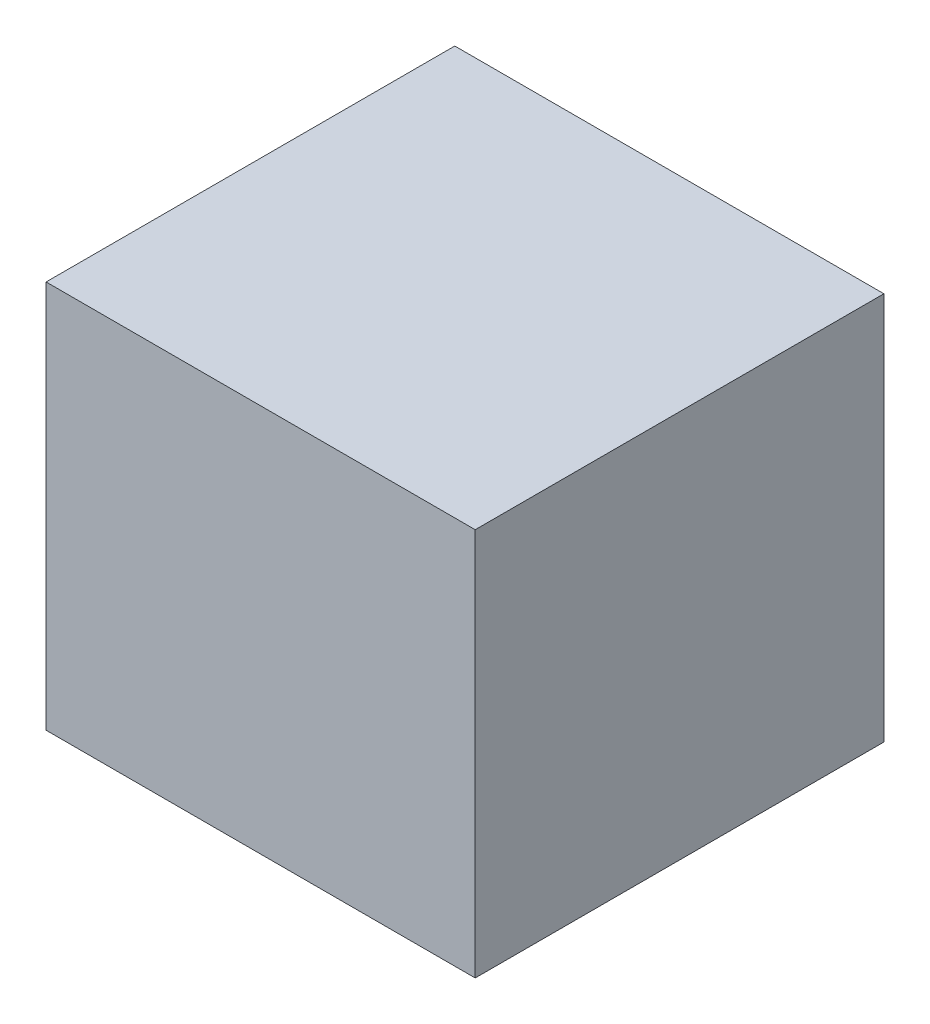
ISO-10303-21;
HEADER;
FILE_DESCRIPTION(('STEP AP214'),'2;1');
FILE_NAME('part.step','',(''),(''),'','','');
FILE_SCHEMA(('AUTOMOTIVE_DESIGN { 1 0 10303 214 1 1 1 1 }'));
ENDSEC;
DATA;
#1=APPLICATION_CONTEXT('core data for automotive mechanical design processes');
#2=APPLICATION_PROTOCOL_DEFINITION('international standard','automotive_design',2000,#1);
#3=PRODUCT_CONTEXT('',#1,'mechanical');
#4=PRODUCT('Part','Part','',(#3));
#5=PRODUCT_RELATED_PRODUCT_CATEGORY('part','',(#4));
#6=PRODUCT_DEFINITION_FORMATION('','',#4);
#7=PRODUCT_DEFINITION_CONTEXT('part definition',#1,'design');
#8=PRODUCT_DEFINITION('design','',#6,#7);
#9=PRODUCT_DEFINITION_SHAPE('','',#8);
#10=(LENGTH_UNIT() NAMED_UNIT(*) SI_UNIT(.MILLI.,.METRE.));
#11=(NAMED_UNIT(*) PLANE_ANGLE_UNIT() SI_UNIT($,.RADIAN.));
#12=(NAMED_UNIT(*) SI_UNIT($,.STERADIAN.) SOLID_ANGLE_UNIT());
#13=UNCERTAINTY_MEASURE_WITH_UNIT(LENGTH_MEASURE(1.E-05),#10,'distance_accuracy_value','');
#14=(GEOMETRIC_REPRESENTATION_CONTEXT(3) GLOBAL_UNCERTAINTY_ASSIGNED_CONTEXT((#13)) GLOBAL_UNIT_ASSIGNED_CONTEXT((#10,
#11,#12)) REPRESENTATION_CONTEXT('',''));
#15=CARTESIAN_POINT('',(0.,0.,0.));
#16=DIRECTION('',(0.,0.,1.));
#17=DIRECTION('',(1.,0.,0.));
#18=AXIS2_PLACEMENT_3D('',#15,#16,#17);
#19=CARTESIAN_POINT('',(0.52500022,-0.47499778,0.));
#20=DIRECTION('',(-1.,0.,0.));
#21=DIRECTION('',(0.,1.,0.));
#22=AXIS2_PLACEMENT_3D('',#19,#20,#21);
#23=PLANE('',#22);
#24=DIRECTION('',(0.,1.,0.));
#25=VECTOR('',#24,1.);
#26=CARTESIAN_POINT('',(0.52500022,-0.47499778,0.));
#27=LINE('',#26,#25);
#28=CARTESIAN_POINT('',(0.52500022,-0.47499778,0.));
#29=VERTEX_POINT('',#28);
#30=CARTESIAN_POINT('',(0.52500022,0.47500032,0.));
#31=VERTEX_POINT('',#30);
#32=EDGE_CURVE('E11',#29,#31,#27,.T.);
#33=ORIENTED_EDGE('',*,*,#32,.T.);
#34=DIRECTION('',(0.,0.,1.));
#35=VECTOR('',#34,1.);
#36=CARTESIAN_POINT('',(0.52500022,0.47500032,0.));
#37=LINE('',#36,#35);
#38=CARTESIAN_POINT('',(0.52500022,0.47500032,1.00000054));
#39=VERTEX_POINT('',#38);
#40=EDGE_CURVE('E24',#31,#39,#37,.T.);
#41=ORIENTED_EDGE('',*,*,#40,.T.);
#42=DIRECTION('',(0.,1.,0.));
#43=VECTOR('',#42,1.);
#44=CARTESIAN_POINT('',(0.52500022,-0.47499778,1.00000054));
#45=LINE('',#44,#43);
#46=CARTESIAN_POINT('',(0.52500022,-0.47499778,1.00000054));
#47=VERTEX_POINT('',#46);
#48=EDGE_CURVE('E87',#47,#39,#45,.T.);
#49=ORIENTED_EDGE('',*,*,#48,.F.);
#50=DIRECTION('',(0.,0.,1.));
#51=VECTOR('',#50,1.);
#52=CARTESIAN_POINT('',(0.52500022,-0.47499778,0.));
#53=LINE('',#52,#51);
#54=EDGE_CURVE('E36',#29,#47,#53,.T.);
#55=ORIENTED_EDGE('',*,*,#54,.F.);
#56=EDGE_LOOP('',(#33,#41,#49,#55));
#57=FACE_BOUND('',#56,.T.);
#58=ADVANCED_FACE('F17',(#57),#23,.F.);
#59=CARTESIAN_POINT('',(0.52500022,0.47500032,0.));
#60=DIRECTION('',(0.,-1.,0.));
#61=DIRECTION('',(-1.,0.,0.));
#62=AXIS2_PLACEMENT_3D('',#59,#60,#61);
#63=PLANE('',#62);
#64=DIRECTION('',(-1.,0.,0.));
#65=VECTOR('',#64,1.);
#66=CARTESIAN_POINT('',(0.52500022,0.47500032,0.));
#67=LINE('',#66,#65);
#68=CARTESIAN_POINT('',(-0.52500022,0.47500032,0.));
#69=VERTEX_POINT('',#68);
#70=EDGE_CURVE('E84',#31,#69,#67,.T.);
#71=ORIENTED_EDGE('',*,*,#70,.T.);
#72=DIRECTION('',(0.,0.,1.));
#73=VECTOR('',#72,1.);
#74=CARTESIAN_POINT('',(-0.52500022,0.47500032,0.));
#75=LINE('',#74,#73);
#76=CARTESIAN_POINT('',(-0.52500022,0.47500032,1.00000054));
#77=VERTEX_POINT('',#76);
#78=EDGE_CURVE('E82',#69,#77,#75,.T.);
#79=ORIENTED_EDGE('',*,*,#78,.T.);
#80=DIRECTION('',(-1.,0.,0.));
#81=VECTOR('',#80,1.);
#82=CARTESIAN_POINT('',(0.52500022,0.47500032,1.00000054));
#83=LINE('',#82,#81);
#84=EDGE_CURVE('E62',#39,#77,#83,.T.);
#85=ORIENTED_EDGE('',*,*,#84,.F.);
#86=ORIENTED_EDGE('',*,*,#40,.F.);
#87=EDGE_LOOP('',(#71,#79,#85,#86));
#88=FACE_BOUND('',#87,.T.);
#89=ADVANCED_FACE('F89',(#88),#63,.F.);
#90=CARTESIAN_POINT('',(-0.52500022,0.47500032,0.));
#91=DIRECTION('',(1.,0.,0.));
#92=DIRECTION('',(0.,-1.,0.));
#93=AXIS2_PLACEMENT_3D('',#90,#91,#92);
#94=PLANE('',#93);
#95=DIRECTION('',(0.,-1.,0.));
#96=VECTOR('',#95,1.);
#97=CARTESIAN_POINT('',(-0.52500022,0.47500032,0.));
#98=LINE('',#97,#96);
#99=CARTESIAN_POINT('',(-0.52500022,-0.47499778,0.));
#100=VERTEX_POINT('',#99);
#101=EDGE_CURVE('E71',#69,#100,#98,.T.);
#102=ORIENTED_EDGE('',*,*,#101,.T.);
#103=DIRECTION('',(0.,0.,1.));
#104=VECTOR('',#103,1.);
#105=CARTESIAN_POINT('',(-0.52500022,-0.47499778,0.));
#106=LINE('',#105,#104);
#107=CARTESIAN_POINT('',(-0.52500022,-0.47499778,1.00000054));
#108=VERTEX_POINT('',#107);
#109=EDGE_CURVE('E65',#100,#108,#106,.T.);
#110=ORIENTED_EDGE('',*,*,#109,.T.);
#111=DIRECTION('',(0.,-1.,0.));
#112=VECTOR('',#111,1.);
#113=CARTESIAN_POINT('',(-0.52500022,0.47500032,1.00000054));
#114=LINE('',#113,#112);
#115=EDGE_CURVE('E57',#77,#108,#114,.T.);
#116=ORIENTED_EDGE('',*,*,#115,.F.);
#117=ORIENTED_EDGE('',*,*,#78,.F.);
#118=EDGE_LOOP('',(#102,#110,#116,#117));
#119=FACE_BOUND('',#118,.T.);
#120=ADVANCED_FACE('F69',(#119),#94,.F.);
#121=CARTESIAN_POINT('',(-0.52500022,-0.47499778,0.));
#122=DIRECTION('',(0.,1.,0.));
#123=DIRECTION('',(1.,0.,0.));
#124=AXIS2_PLACEMENT_3D('',#121,#122,#123);
#125=PLANE('',#124);
#126=DIRECTION('',(1.,0.,0.));
#127=VECTOR('',#126,1.);
#128=CARTESIAN_POINT('',(-0.52500022,-0.47499778,0.));
#129=LINE('',#128,#127);
#130=EDGE_CURVE('E66',#100,#29,#129,.T.);
#131=ORIENTED_EDGE('',*,*,#130,.T.);
#132=ORIENTED_EDGE('',*,*,#54,.T.);
#133=DIRECTION('',(1.,0.,0.));
#134=VECTOR('',#133,1.);
#135=CARTESIAN_POINT('',(-0.52500022,-0.47499778,1.00000054));
#136=LINE('',#135,#134);
#137=EDGE_CURVE('E61',#108,#47,#136,.T.);
#138=ORIENTED_EDGE('',*,*,#137,.F.);
#139=ORIENTED_EDGE('',*,*,#109,.F.);
#140=EDGE_LOOP('',(#131,#132,#138,#139));
#141=FACE_BOUND('',#140,.T.);
#142=ADVANCED_FACE('F76',(#141),#125,.F.);
#143=CARTESIAN_POINT('',(0.52500022,-0.47499778,0.));
#144=DIRECTION('',(0.,0.,-1.));
#145=DIRECTION('',(-1.,0.,0.));
#146=AXIS2_PLACEMENT_3D('',#143,#144,#145);
#147=PLANE('',#146);
#148=ORIENTED_EDGE('',*,*,#130,.F.);
#149=ORIENTED_EDGE('',*,*,#101,.F.);
#150=ORIENTED_EDGE('',*,*,#70,.F.);
#151=ORIENTED_EDGE('',*,*,#32,.F.);
#152=EDGE_LOOP('',(#148,#149,#150,#151));
#153=FACE_BOUND('',#152,.T.);
#154=ADVANCED_FACE('F91',(#153),#147,.T.);
#155=CARTESIAN_POINT('',(0.52500022,-0.47499778,1.00000054));
#156=DIRECTION('',(0.,0.,-1.));
#157=DIRECTION('',(-1.,0.,0.));
#158=AXIS2_PLACEMENT_3D('',#155,#156,#157);
#159=PLANE('',#158);
#160=ORIENTED_EDGE('',*,*,#48,.T.);
#161=ORIENTED_EDGE('',*,*,#84,.T.);
#162=ORIENTED_EDGE('',*,*,#115,.T.);
#163=ORIENTED_EDGE('',*,*,#137,.T.);
#164=EDGE_LOOP('',(#160,#161,#162,#163));
#165=FACE_BOUND('',#164,.T.);
#166=ADVANCED_FACE('F59',(#165),#159,.F.);
#167=CLOSED_SHELL('',(#58,#89,#120,#142,#154,#166));
#168=MANIFOLD_SOLID_BREP('B1',#167);
#169=ADVANCED_BREP_SHAPE_REPRESENTATION('',(#18,#168),#14);
#170=SHAPE_DEFINITION_REPRESENTATION(#9,#169);
ENDSEC;
END-ISO-10303-21;
